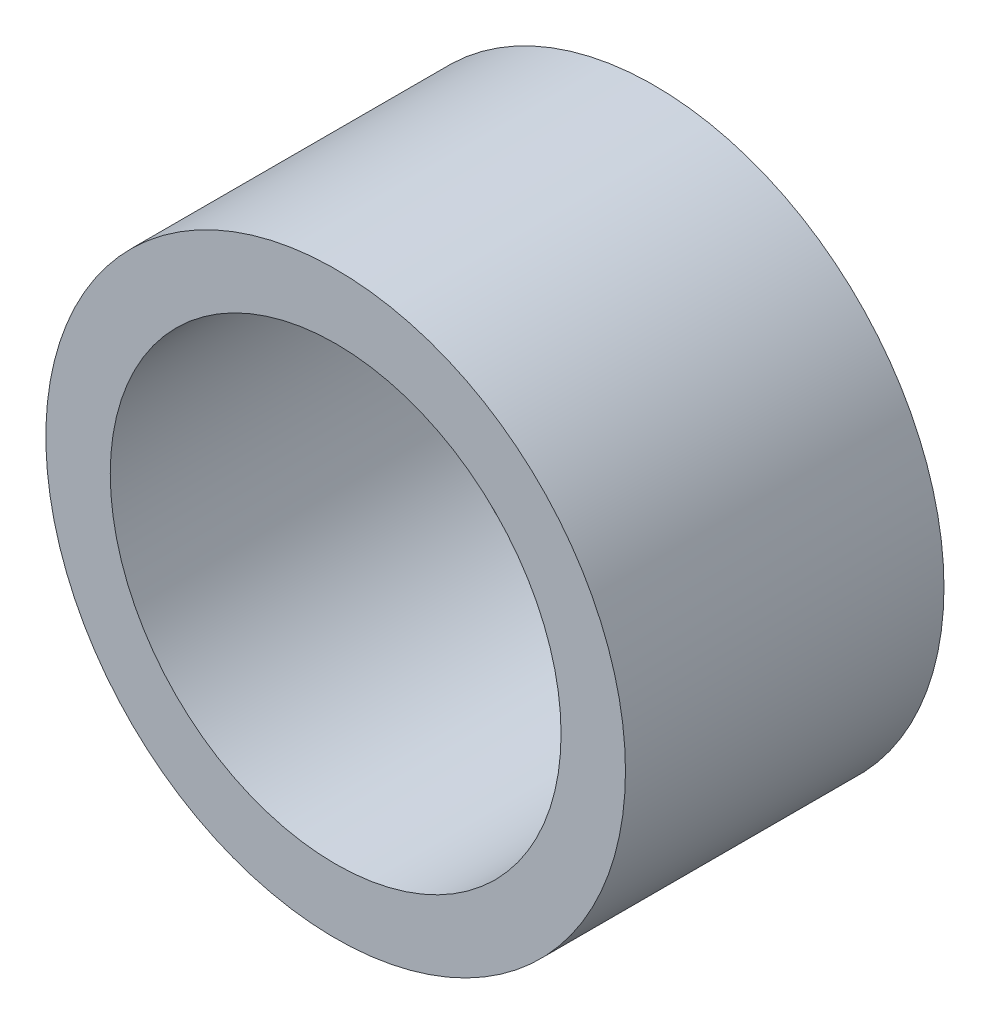
ISO-10303-21;
HEADER;
FILE_DESCRIPTION(('STEP AP214'),'2;1');
FILE_NAME('part.step','',(''),(''),'','','');
FILE_SCHEMA(('AUTOMOTIVE_DESIGN { 1 0 10303 214 1 1 1 1 }'));
ENDSEC;
DATA;
#1=APPLICATION_CONTEXT('core data for automotive mechanical design processes');
#2=APPLICATION_PROTOCOL_DEFINITION('international standard','automotive_design',2000,#1);
#3=PRODUCT_CONTEXT('',#1,'mechanical');
#4=PRODUCT('Part','Part','',(#3));
#5=PRODUCT_RELATED_PRODUCT_CATEGORY('part','',(#4));
#6=PRODUCT_DEFINITION_FORMATION('','',#4);
#7=PRODUCT_DEFINITION_CONTEXT('part definition',#1,'design');
#8=PRODUCT_DEFINITION('design','',#6,#7);
#9=PRODUCT_DEFINITION_SHAPE('','',#8);
#10=(LENGTH_UNIT() NAMED_UNIT(*) SI_UNIT(.MILLI.,.METRE.));
#11=(NAMED_UNIT(*) PLANE_ANGLE_UNIT() SI_UNIT($,.RADIAN.));
#12=(NAMED_UNIT(*) SI_UNIT($,.STERADIAN.) SOLID_ANGLE_UNIT());
#13=UNCERTAINTY_MEASURE_WITH_UNIT(LENGTH_MEASURE(1.E-05),#10,'distance_accuracy_value','');
#14=(GEOMETRIC_REPRESENTATION_CONTEXT(3) GLOBAL_UNCERTAINTY_ASSIGNED_CONTEXT((#13)) GLOBAL_UNIT_ASSIGNED_CONTEXT((#10,
#11,#12)) REPRESENTATION_CONTEXT('',''));
#15=CARTESIAN_POINT('',(0.,0.,0.));
#16=DIRECTION('',(0.,0.,1.));
#17=DIRECTION('',(1.,0.,0.));
#18=AXIS2_PLACEMENT_3D('',#15,#16,#17);
#19=CARTESIAN_POINT('',(0.,0.,15.70228));
#20=DIRECTION('',(0.,0.,1.));
#21=DIRECTION('',(1.,0.,0.));
#22=AXIS2_PLACEMENT_3D('',#19,#20,#21);
#23=PLANE('',#22);
#24=CARTESIAN_POINT('',(0.,0.,15.70228));
#25=DIRECTION('',(0.,0.,1.));
#26=DIRECTION('',(1.,0.,0.));
#27=AXIS2_PLACEMENT_3D('',#24,#25,#26);
#28=CIRCLE('',#27,14.2875);
#29=CARTESIAN_POINT('',(14.2875,0.,15.70228));
#30=VERTEX_POINT('',#29);
#31=EDGE_CURVE('E10',#30,#30,#28,.T.);
#32=ORIENTED_EDGE('',*,*,#31,.T.);
#33=EDGE_LOOP('',(#32));
#34=FACE_BOUND('',#33,.T.);
#35=CARTESIAN_POINT('',(0.,0.,15.70228));
#36=DIRECTION('',(0.,0.,1.));
#37=DIRECTION('',(1.,0.,0.));
#38=AXIS2_PLACEMENT_3D('',#35,#36,#37);
#39=CIRCLE('',#38,11.1125);
#40=CARTESIAN_POINT('',(11.1125,0.,15.70228));
#41=VERTEX_POINT('',#40);
#42=EDGE_CURVE('E42',#41,#41,#39,.T.);
#43=ORIENTED_EDGE('',*,*,#42,.F.);
#44=EDGE_LOOP('',(#43));
#45=FACE_BOUND('',#44,.T.);
#46=ADVANCED_FACE('F31',(#34,#45),#23,.T.);
#47=CARTESIAN_POINT('',(0.,0.,0.));
#48=DIRECTION('',(0.,0.,1.));
#49=DIRECTION('',(1.,0.,0.));
#50=AXIS2_PLACEMENT_3D('',#47,#48,#49);
#51=PLANE('',#50);
#52=CARTESIAN_POINT('',(0.,0.,0.));
#53=DIRECTION('',(0.,0.,1.));
#54=DIRECTION('',(1.,0.,0.));
#55=AXIS2_PLACEMENT_3D('',#52,#53,#54);
#56=CIRCLE('',#55,14.2875);
#57=CARTESIAN_POINT('',(14.2875,0.,0.));
#58=VERTEX_POINT('',#57);
#59=EDGE_CURVE('E35',#58,#58,#56,.T.);
#60=ORIENTED_EDGE('',*,*,#59,.F.);
#61=EDGE_LOOP('',(#60));
#62=FACE_BOUND('',#61,.T.);
#63=CARTESIAN_POINT('',(0.,0.,0.));
#64=DIRECTION('',(0.,0.,1.));
#65=DIRECTION('',(1.,0.,0.));
#66=AXIS2_PLACEMENT_3D('',#63,#64,#65);
#67=CIRCLE('',#66,11.1125);
#68=CARTESIAN_POINT('',(11.1125,0.,0.));
#69=VERTEX_POINT('',#68);
#70=EDGE_CURVE('E44',#69,#69,#67,.T.);
#71=ORIENTED_EDGE('',*,*,#70,.T.);
#72=EDGE_LOOP('',(#71));
#73=FACE_BOUND('',#72,.T.);
#74=ADVANCED_FACE('F54',(#62,#73),#51,.F.);
#75=CARTESIAN_POINT('',(0.,0.,15.70228));
#76=DIRECTION('',(0.,0.,-1.));
#77=DIRECTION('',(-1.,0.,0.));
#78=AXIS2_PLACEMENT_3D('',#75,#76,#77);
#79=CYLINDRICAL_SURFACE('',#78,14.2875);
#80=ORIENTED_EDGE('',*,*,#31,.F.);
#81=EDGE_LOOP('',(#80));
#82=FACE_BOUND('',#81,.T.);
#83=ORIENTED_EDGE('',*,*,#59,.T.);
#84=EDGE_LOOP('',(#83));
#85=FACE_BOUND('',#84,.T.);
#86=ADVANCED_FACE('F33',(#82,#85),#79,.T.);
#87=CARTESIAN_POINT('',(0.,0.,15.70228));
#88=DIRECTION('',(0.,0.,-1.));
#89=DIRECTION('',(-1.,0.,0.));
#90=AXIS2_PLACEMENT_3D('',#87,#88,#89);
#91=CYLINDRICAL_SURFACE('',#90,11.1125);
#92=ORIENTED_EDGE('',*,*,#42,.T.);
#93=EDGE_LOOP('',(#92));
#94=FACE_BOUND('',#93,.T.);
#95=ORIENTED_EDGE('',*,*,#70,.F.);
#96=EDGE_LOOP('',(#95));
#97=FACE_BOUND('',#96,.T.);
#98=ADVANCED_FACE('F50',(#94,#97),#91,.F.);
#99=CLOSED_SHELL('',(#46,#74,#86,#98));
#100=MANIFOLD_SOLID_BREP('B2',#99);
#101=ADVANCED_BREP_SHAPE_REPRESENTATION('',(#18,#100),#14);
#102=SHAPE_DEFINITION_REPRESENTATION(#9,#101);
ENDSEC;
END-ISO-10303-21;
